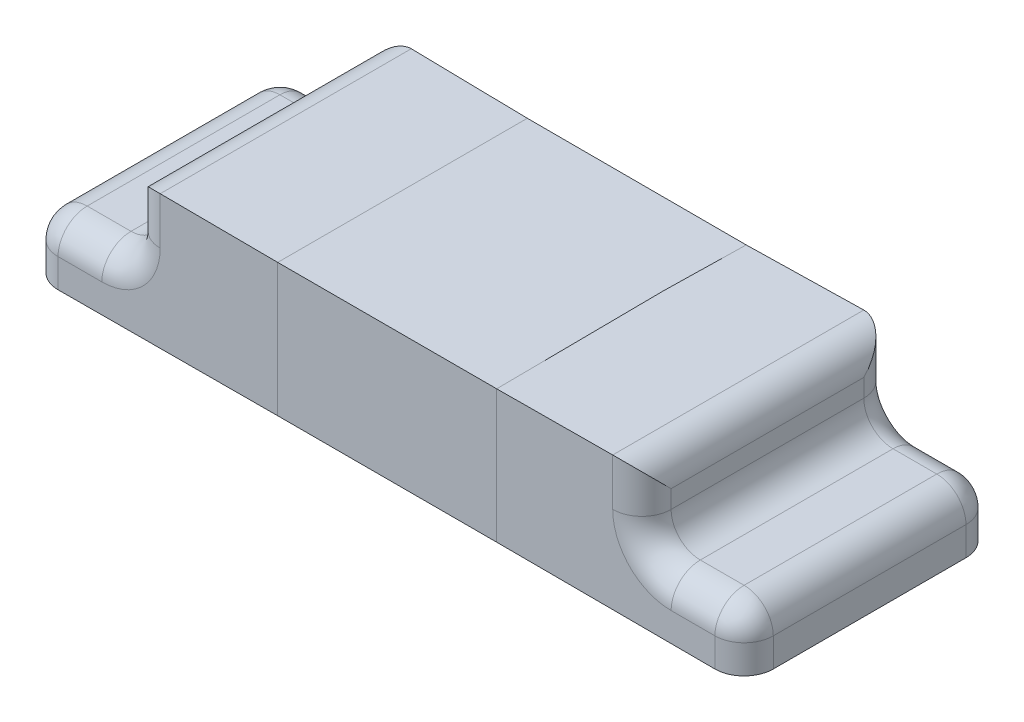
ISO-10303-21;
HEADER;
FILE_DESCRIPTION(('STEP AP214'),'2;1');
FILE_NAME('part.step','',(''),(''),'','','');
FILE_SCHEMA(('AUTOMOTIVE_DESIGN { 1 0 10303 214 1 1 1 1 }'));
ENDSEC;
DATA;
#1=APPLICATION_CONTEXT('core data for automotive mechanical design processes');
#2=APPLICATION_PROTOCOL_DEFINITION('international standard','automotive_design',2000,#1);
#3=PRODUCT_CONTEXT('',#1,'mechanical');
#4=PRODUCT('Part','Part','',(#3));
#5=PRODUCT_RELATED_PRODUCT_CATEGORY('part','',(#4));
#6=PRODUCT_DEFINITION_FORMATION('','',#4);
#7=PRODUCT_DEFINITION_CONTEXT('part definition',#1,'design');
#8=PRODUCT_DEFINITION('design','',#6,#7);
#9=PRODUCT_DEFINITION_SHAPE('','',#8);
#10=(LENGTH_UNIT() NAMED_UNIT(*) SI_UNIT(.MILLI.,.METRE.));
#11=(NAMED_UNIT(*) PLANE_ANGLE_UNIT() SI_UNIT($,.RADIAN.));
#12=(NAMED_UNIT(*) SI_UNIT($,.STERADIAN.) SOLID_ANGLE_UNIT());
#13=UNCERTAINTY_MEASURE_WITH_UNIT(LENGTH_MEASURE(1.E-05),#10,'distance_accuracy_value','');
#14=(GEOMETRIC_REPRESENTATION_CONTEXT(3) GLOBAL_UNCERTAINTY_ASSIGNED_CONTEXT((#13)) GLOBAL_UNIT_ASSIGNED_CONTEXT((#10,
#11,#12)) REPRESENTATION_CONTEXT('',''));
#15=CARTESIAN_POINT('',(0.,0.,0.));
#16=DIRECTION('',(0.,0.,1.));
#17=DIRECTION('',(1.,0.,0.));
#18=AXIS2_PLACEMENT_3D('',#15,#16,#17);
#19=CARTESIAN_POINT('',(0.875,0.,0.));
#20=DIRECTION('',(-1.,0.,0.));
#21=DIRECTION('',(0.,0.,1.));
#22=AXIS2_PLACEMENT_3D('',#19,#20,#21);
#23=PLANE('',#22);
#24=DIRECTION('',(0.,1.,0.));
#25=VECTOR('',#24,1.);
#26=CARTESIAN_POINT('',(0.875,0.,-0.33));
#27=LINE('',#26,#25);
#28=CARTESIAN_POINT('',(0.875,0.298442990090282,-0.33));
#29=VERTEX_POINT('',#28);
#30=CARTESIAN_POINT('',(0.875,0.36,-0.33));
#31=VERTEX_POINT('',#30);
#32=EDGE_CURVE('E509',#29,#31,#27,.T.);
#33=ORIENTED_EDGE('',*,*,#32,.T.);
#34=DIRECTION('',(0.,0.,1.));
#35=VECTOR('',#34,1.);
#36=CARTESIAN_POINT('',(0.875,0.36,0.));
#37=LINE('',#36,#35);
#38=CARTESIAN_POINT('',(0.875,0.36,0.33));
#39=VERTEX_POINT('',#38);
#40=EDGE_CURVE('E484',#31,#39,#37,.T.);
#41=ORIENTED_EDGE('',*,*,#40,.T.);
#42=DIRECTION('',(0.,-1.,0.));
#43=VECTOR('',#42,1.);
#44=CARTESIAN_POINT('',(0.875,0.,0.33));
#45=LINE('',#44,#43);
#46=CARTESIAN_POINT('',(0.875,0.298442990090282,0.33));
#47=VERTEX_POINT('',#46);
#48=EDGE_CURVE('E512',#39,#47,#45,.T.);
#49=ORIENTED_EDGE('',*,*,#48,.T.);
#50=DIRECTION('',(0.,0.,1.));
#51=VECTOR('',#50,1.);
#52=CARTESIAN_POINT('',(0.875,0.298442990090282,-0.43));
#53=LINE('',#52,#51);
#54=EDGE_CURVE('E274',#47,#29,#53,.F.);
#55=ORIENTED_EDGE('',*,*,#54,.T.);
#56=EDGE_LOOP('',(#33,#41,#49,#55));
#57=FACE_BOUND('',#56,.T.);
#58=ADVANCED_FACE('F41',(#57),#23,.F.);
#59=CARTESIAN_POINT('',(0.375,0.,-0.425));
#60=DIRECTION('',(0.,0.,1.));
#61=DIRECTION('',(1.,0.,0.));
#62=AXIS2_PLACEMENT_3D('',#59,#60,#61);
#63=PLANE('',#62);
#64=CARTESIAN_POINT('',(-0.375,0.,-0.425));
#65=DIRECTION('',(0.,1.,0.));
#66=VECTOR('',#65,1.);
#67=LINE('',#64,#66);
#68=CARTESIAN_POINT('',(-0.375,0.,-0.4275));
#69=VERTEX_POINT('',#68);
#70=CARTESIAN_POINT('',(-0.375,0.455,-0.4275));
#71=VERTEX_POINT('',#70);
#72=EDGE_CURVE('E234',#69,#71,#67,.T.);
#73=ORIENTED_EDGE('',*,*,#72,.T.);
#74=DIRECTION('',(-1.,0.,0.));
#75=VECTOR('',#74,1.);
#76=CARTESIAN_POINT('',(0.375,0.45,-0.425));
#77=LINE('',#76,#75);
#78=CARTESIAN_POINT('',(0.375,0.454472135955,-0.4272360679775));
#79=VERTEX_POINT('',#78);
#80=EDGE_CURVE('E271',#79,#71,#77,.T.);
#81=ORIENTED_EDGE('',*,*,#80,.F.);
#82=CARTESIAN_POINT('',(0.375,0.,-0.43));
#83=DIRECTION('',(0.,1.,0.));
#84=VECTOR('',#83,1.);
#85=LINE('',#82,#84);
#86=CARTESIAN_POINT('',(0.375,0.,-0.4275));
#87=VERTEX_POINT('',#86);
#88=EDGE_CURVE('E250',#87,#79,#85,.T.);
#89=ORIENTED_EDGE('',*,*,#88,.F.);
#90=DIRECTION('',(-1.,0.,0.));
#91=VECTOR('',#90,1.);
#92=CARTESIAN_POINT('',(0.375,0.,-0.425));
#93=LINE('',#92,#91);
#94=EDGE_CURVE('E223',#87,#69,#93,.T.);
#95=ORIENTED_EDGE('',*,*,#94,.T.);
#96=EDGE_LOOP('',(#73,#81,#89,#95));
#97=FACE_BOUND('',#96,.T.);
#98=ADVANCED_FACE('F248',(#97),#63,.F.);
#99=CARTESIAN_POINT('',(0.375,0.45,0.425));
#100=DIRECTION('',(0.,-1.,0.));
#101=DIRECTION('',(0.,0.,-1.));
#102=AXIS2_PLACEMENT_3D('',#99,#100,#101);
#103=PLANE('',#102);
#104=CARTESIAN_POINT('',(-0.375,0.45,-0.425));
#105=DIRECTION('',(0.,0.,1.));
#106=VECTOR('',#105,1.);
#107=LINE('',#104,#106);
#108=CARTESIAN_POINT('',(-0.375,0.455,0.4275));
#109=VERTEX_POINT('',#108);
#110=EDGE_CURVE('E244',#71,#109,#107,.T.);
#111=ORIENTED_EDGE('',*,*,#110,.T.);
#112=DIRECTION('',(-1.,0.,0.));
#113=VECTOR('',#112,1.);
#114=CARTESIAN_POINT('',(0.375,0.45,0.425));
#115=LINE('',#114,#113);
#116=CARTESIAN_POINT('',(0.375,0.455,0.4275));
#117=VERTEX_POINT('',#116);
#118=EDGE_CURVE('E256',#117,#109,#115,.T.);
#119=ORIENTED_EDGE('',*,*,#118,.F.);
#120=DIRECTION('',(0.,0.,1.));
#121=VECTOR('',#120,1.);
#122=CARTESIAN_POINT('',(0.375,0.45,0.425));
#123=LINE('',#122,#121);
#124=EDGE_CURVE('E259',#79,#117,#123,.T.);
#125=ORIENTED_EDGE('',*,*,#124,.F.);
#126=ORIENTED_EDGE('',*,*,#80,.T.);
#127=EDGE_LOOP('',(#111,#119,#125,#126));
#128=FACE_BOUND('',#127,.T.);
#129=ADVANCED_FACE('F298',(#128),#103,.F.);
#130=CARTESIAN_POINT('',(0.375,0.,0.425));
#131=DIRECTION('',(0.,0.,-1.));
#132=DIRECTION('',(-1.,0.,0.));
#133=AXIS2_PLACEMENT_3D('',#130,#131,#132);
#134=PLANE('',#133);
#135=CARTESIAN_POINT('',(-0.375,0.45,0.425));
#136=DIRECTION('',(0.,-1.,0.));
#137=VECTOR('',#136,1.);
#138=LINE('',#135,#137);
#139=CARTESIAN_POINT('',(-0.375,0.,0.4275));
#140=VERTEX_POINT('',#139);
#141=EDGE_CURVE('E339',#109,#140,#138,.T.);
#142=ORIENTED_EDGE('',*,*,#141,.T.);
#143=DIRECTION('',(-1.,0.,0.));
#144=VECTOR('',#143,1.);
#145=CARTESIAN_POINT('',(0.375,0.,0.425));
#146=LINE('',#145,#144);
#147=CARTESIAN_POINT('',(0.375,0.,0.4275));
#148=VERTEX_POINT('',#147);
#149=EDGE_CURVE('E252',#148,#140,#146,.T.);
#150=ORIENTED_EDGE('',*,*,#149,.F.);
#151=CARTESIAN_POINT('',(0.375,0.46,0.43));
#152=DIRECTION('',(0.,-1.,0.));
#153=VECTOR('',#152,1.);
#154=LINE('',#151,#153);
#155=EDGE_CURVE('E253',#117,#148,#154,.T.);
#156=ORIENTED_EDGE('',*,*,#155,.F.);
#157=ORIENTED_EDGE('',*,*,#118,.T.);
#158=EDGE_LOOP('',(#142,#150,#156,#157));
#159=FACE_BOUND('',#158,.T.);
#160=ADVANCED_FACE('F288',(#159),#134,.F.);
#161=CARTESIAN_POINT('',(0.375,0.,0.425));
#162=DIRECTION('',(0.,1.,0.));
#163=DIRECTION('',(0.,0.,1.));
#164=AXIS2_PLACEMENT_3D('',#161,#162,#163);
#165=PLANE('',#164);
#166=DIRECTION('',(0.,0.,-1.));
#167=VECTOR('',#166,1.);
#168=CARTESIAN_POINT('',(-1.225,0.,0.43));
#169=LINE('',#168,#167);
#170=CARTESIAN_POINT('',(-1.225,0.,0.33));
#171=VERTEX_POINT('',#170);
#172=CARTESIAN_POINT('',(-1.225,0.,-0.33));
#173=VERTEX_POINT('',#172);
#174=EDGE_CURVE('E328',#171,#173,#169,.T.);
#175=ORIENTED_EDGE('',*,*,#174,.T.);
#176=CARTESIAN_POINT('',(-1.125,0.,-0.33));
#177=DIRECTION('',(0.,1.,0.));
#178=DIRECTION('',(0.,0.,1.));
#179=AXIS2_PLACEMENT_3D('',#176,#177,#178);
#180=CIRCLE('',#179,0.1);
#181=CARTESIAN_POINT('',(-1.125,0.,-0.43));
#182=VERTEX_POINT('',#181);
#183=EDGE_CURVE('E226',#173,#182,#180,.F.);
#184=ORIENTED_EDGE('',*,*,#183,.T.);
#185=DIRECTION('',(1.,0.,0.));
#186=VECTOR('',#185,1.);
#187=CARTESIAN_POINT('',(-0.875,0.,-0.43));
#188=LINE('',#187,#186);
#189=EDGE_CURVE('E217',#182,#69,#188,.T.);
#190=ORIENTED_EDGE('',*,*,#189,.T.);
#191=ORIENTED_EDGE('',*,*,#94,.F.);
#192=DIRECTION('',(-1.,0.,0.));
#193=VECTOR('',#192,1.);
#194=CARTESIAN_POINT('',(0.875,0.,-0.43));
#195=LINE('',#194,#193);
#196=CARTESIAN_POINT('',(1.125,0.,-0.43));
#197=VERTEX_POINT('',#196);
#198=EDGE_CURVE('E466',#197,#87,#195,.T.);
#199=ORIENTED_EDGE('',*,*,#198,.F.);
#200=CARTESIAN_POINT('',(1.125,0.,-0.33));
#201=DIRECTION('',(0.,1.,0.));
#202=DIRECTION('',(0.,0.,1.));
#203=AXIS2_PLACEMENT_3D('',#200,#201,#202);
#204=CIRCLE('',#203,0.1);
#205=CARTESIAN_POINT('',(1.225,0.,-0.33));
#206=VERTEX_POINT('',#205);
#207=EDGE_CURVE('E664',#197,#206,#204,.F.);
#208=ORIENTED_EDGE('',*,*,#207,.T.);
#209=DIRECTION('',(0.,0.,-1.));
#210=VECTOR('',#209,1.);
#211=CARTESIAN_POINT('',(1.225,0.,0.43));
#212=LINE('',#211,#210);
#213=CARTESIAN_POINT('',(1.225,0.,0.33));
#214=VERTEX_POINT('',#213);
#215=EDGE_CURVE('E459',#214,#206,#212,.T.);
#216=ORIENTED_EDGE('',*,*,#215,.F.);
#217=CARTESIAN_POINT('',(1.125,0.,0.33));
#218=DIRECTION('',(0.,1.,0.));
#219=DIRECTION('',(0.,0.,1.));
#220=AXIS2_PLACEMENT_3D('',#217,#218,#219);
#221=CIRCLE('',#220,0.1);
#222=CARTESIAN_POINT('',(1.125,0.,0.43));
#223=VERTEX_POINT('',#222);
#224=EDGE_CURVE('E660',#214,#223,#221,.F.);
#225=ORIENTED_EDGE('',*,*,#224,.T.);
#226=DIRECTION('',(-1.,0.,0.));
#227=VECTOR('',#226,1.);
#228=CARTESIAN_POINT('',(0.875,0.,0.43));
#229=LINE('',#228,#227);
#230=EDGE_CURVE('E410',#223,#148,#229,.T.);
#231=ORIENTED_EDGE('',*,*,#230,.T.);
#232=ORIENTED_EDGE('',*,*,#149,.T.);
#233=DIRECTION('',(1.,0.,0.));
#234=VECTOR('',#233,1.);
#235=CARTESIAN_POINT('',(-0.875,0.,0.43));
#236=LINE('',#235,#234);
#237=CARTESIAN_POINT('',(-1.125,0.,0.43));
#238=VERTEX_POINT('',#237);
#239=EDGE_CURVE('E231',#238,#140,#236,.T.);
#240=ORIENTED_EDGE('',*,*,#239,.F.);
#241=CARTESIAN_POINT('',(-1.125,0.,0.33));
#242=DIRECTION('',(0.,1.,0.));
#243=DIRECTION('',(0.,0.,1.));
#244=AXIS2_PLACEMENT_3D('',#241,#242,#243);
#245=CIRCLE('',#244,0.1);
#246=EDGE_CURVE('E64',#238,#171,#245,.F.);
#247=ORIENTED_EDGE('',*,*,#246,.T.);
#248=EDGE_LOOP('',(#175,#184,#190,#191,#199,#208,#216,#225,#231,#232,#240,#247));
#249=FACE_BOUND('',#248,.T.);
#250=ADVANCED_FACE('F220',(#249),#165,.F.);
#251=CARTESIAN_POINT('',(0.875,0.,-0.43));
#252=DIRECTION('',(0.,0.,1.));
#253=DIRECTION('',(1.,0.,0.));
#254=AXIS2_PLACEMENT_3D('',#251,#252,#253);
#255=PLANE('',#254);
#256=DIRECTION('',(-1.,0.,0.));
#257=VECTOR('',#256,1.);
#258=CARTESIAN_POINT('',(0.875,0.098442990090282,-0.43));
#259=LINE('',#258,#257);
#260=CARTESIAN_POINT('',(0.975,0.098442990090282,-0.43));
#261=VERTEX_POINT('',#260);
#262=CARTESIAN_POINT('',(1.125,0.098442990090282,-0.43));
#263=VERTEX_POINT('',#262);
#264=EDGE_CURVE('E486',#261,#263,#259,.F.);
#265=ORIENTED_EDGE('',*,*,#264,.T.);
#266=DIRECTION('',(0.,1.,0.));
#267=VECTOR('',#266,1.);
#268=CARTESIAN_POINT('',(1.125,0.,-0.43));
#269=LINE('',#268,#267);
#270=EDGE_CURVE('E465',#263,#197,#269,.F.);
#271=ORIENTED_EDGE('',*,*,#270,.T.);
#272=ORIENTED_EDGE('',*,*,#198,.T.);
#273=ORIENTED_EDGE('',*,*,#88,.T.);
#274=DIRECTION('',(-1.,0.,0.));
#275=VECTOR('',#274,1.);
#276=CARTESIAN_POINT('',(0.875,0.46,-0.43));
#277=LINE('',#276,#275);
#278=CARTESIAN_POINT('',(0.775,0.46,-0.43));
#279=VERTEX_POINT('',#278);
#280=EDGE_CURVE('E245',#279,#79,#277,.T.);
#281=ORIENTED_EDGE('',*,*,#280,.F.);
#282=DIRECTION('',(0.,1.,0.));
#283=VECTOR('',#282,1.);
#284=CARTESIAN_POINT('',(0.775,0.,-0.43));
#285=LINE('',#284,#283);
#286=CARTESIAN_POINT('',(0.775,0.298442990090282,-0.43));
#287=VERTEX_POINT('',#286);
#288=EDGE_CURVE('E411',#279,#287,#285,.F.);
#289=ORIENTED_EDGE('',*,*,#288,.T.);
#290=CARTESIAN_POINT('',(0.975,0.298442990090282,-0.43));
#291=DIRECTION('',(0.,0.,1.));
#292=DIRECTION('',(1.,0.,0.));
#293=AXIS2_PLACEMENT_3D('',#290,#291,#292);
#294=CIRCLE('',#293,0.2);
#295=EDGE_CURVE('E488',#261,#287,#294,.F.);
#296=ORIENTED_EDGE('',*,*,#295,.F.);
#297=EDGE_LOOP('',(#265,#271,#272,#273,#281,#289,#296));
#298=FACE_BOUND('',#297,.T.);
#299=ADVANCED_FACE('F496',(#298),#255,.F.);
#300=CARTESIAN_POINT('',(0.875,0.46,0.43));
#301=DIRECTION('',(0.,-1.,0.));
#302=DIRECTION('',(0.,0.,-1.));
#303=AXIS2_PLACEMENT_3D('',#300,#301,#302);
#304=PLANE('',#303);
#305=DIRECTION('',(-1.,0.,0.));
#306=VECTOR('',#305,1.);
#307=CARTESIAN_POINT('',(0.875,0.46,0.43));
#308=LINE('',#307,#306);
#309=CARTESIAN_POINT('',(0.775,0.46,0.43));
#310=VERTEX_POINT('',#309);
#311=EDGE_CURVE('E407',#310,#117,#308,.T.);
#312=ORIENTED_EDGE('',*,*,#311,.F.);
#313=DIRECTION('',(0.,0.,1.));
#314=VECTOR('',#313,1.);
#315=CARTESIAN_POINT('',(0.775,0.46,0.43));
#316=LINE('',#315,#314);
#317=EDGE_CURVE('E420',#310,#279,#316,.F.);
#318=ORIENTED_EDGE('',*,*,#317,.T.);
#319=ORIENTED_EDGE('',*,*,#280,.T.);
#320=DIRECTION('',(0.,0.,1.));
#321=VECTOR('',#320,1.);
#322=CARTESIAN_POINT('',(0.375,0.46,0.43));
#323=LINE('',#322,#321);
#324=EDGE_CURVE('E469',#79,#117,#323,.T.);
#325=ORIENTED_EDGE('',*,*,#324,.T.);
#326=EDGE_LOOP('',(#312,#318,#319,#325));
#327=FACE_BOUND('',#326,.T.);
#328=ADVANCED_FACE('F390',(#327),#304,.F.);
#329=CARTESIAN_POINT('',(0.875,0.,0.43));
#330=DIRECTION('',(0.,0.,-1.));
#331=DIRECTION('',(-1.,0.,0.));
#332=AXIS2_PLACEMENT_3D('',#329,#330,#331);
#333=PLANE('',#332);
#334=ORIENTED_EDGE('',*,*,#230,.F.);
#335=DIRECTION('',(0.,-1.,0.));
#336=VECTOR('',#335,1.);
#337=CARTESIAN_POINT('',(1.125,0.,0.43));
#338=LINE('',#337,#336);
#339=CARTESIAN_POINT('',(1.125,0.098442990090282,0.43));
#340=VERTEX_POINT('',#339);
#341=EDGE_CURVE('E666',#223,#340,#338,.F.);
#342=ORIENTED_EDGE('',*,*,#341,.T.);
#343=DIRECTION('',(-1.,0.,0.));
#344=VECTOR('',#343,1.);
#345=CARTESIAN_POINT('',(0.875,0.098442990090282,0.43));
#346=LINE('',#345,#344);
#347=CARTESIAN_POINT('',(0.975,0.098442990090282,0.43));
#348=VERTEX_POINT('',#347);
#349=EDGE_CURVE('E416',#340,#348,#346,.T.);
#350=ORIENTED_EDGE('',*,*,#349,.T.);
#351=CARTESIAN_POINT('',(0.975,0.298442990090282,0.43));
#352=DIRECTION('',(0.,0.,-1.));
#353=DIRECTION('',(-1.,0.,0.));
#354=AXIS2_PLACEMENT_3D('',#351,#352,#353);
#355=CIRCLE('',#354,0.2);
#356=CARTESIAN_POINT('',(0.775,0.298442990090282,0.43));
#357=VERTEX_POINT('',#356);
#358=EDGE_CURVE('E413',#357,#348,#355,.F.);
#359=ORIENTED_EDGE('',*,*,#358,.F.);
#360=DIRECTION('',(0.,-1.,0.));
#361=VECTOR('',#360,1.);
#362=CARTESIAN_POINT('',(0.775,0.,0.43));
#363=LINE('',#362,#361);
#364=EDGE_CURVE('E418',#357,#310,#363,.F.);
#365=ORIENTED_EDGE('',*,*,#364,.T.);
#366=ORIENTED_EDGE('',*,*,#311,.T.);
#367=ORIENTED_EDGE('',*,*,#155,.T.);
#368=EDGE_LOOP('',(#334,#342,#350,#359,#365,#366,#367));
#369=FACE_BOUND('',#368,.T.);
#370=ADVANCED_FACE('F385',(#369),#333,.F.);
#371=CARTESIAN_POINT('',(0.375,0.,0.));
#372=DIRECTION('',(-1.,0.,0.));
#373=DIRECTION('',(0.,0.,1.));
#374=AXIS2_PLACEMENT_3D('',#371,#372,#373);
#375=PLANE('',#374);
#376=ORIENTED_EDGE('',*,*,#324,.F.);
#377=ORIENTED_EDGE('',*,*,#124,.T.);
#378=EDGE_LOOP('',(#376,#377));
#379=FACE_BOUND('',#378,.T.);
#380=ADVANCED_FACE('F378',(#379),#375,.T.);
#381=CARTESIAN_POINT('',(1.225,0.198442990090282,0.43));
#382=DIRECTION('',(0.,-1.,0.));
#383=DIRECTION('',(0.,0.,-1.));
#384=AXIS2_PLACEMENT_3D('',#381,#382,#383);
#385=PLANE('',#384);
#386=DIRECTION('',(-1.,0.,0.));
#387=VECTOR('',#386,1.);
#388=CARTESIAN_POINT('',(1.225,0.198442990090282,-0.33));
#389=LINE('',#388,#387);
#390=CARTESIAN_POINT('',(1.125,0.198442990090282,-0.33));
#391=VERTEX_POINT('',#390);
#392=CARTESIAN_POINT('',(0.975,0.198442990090282,-0.33));
#393=VERTEX_POINT('',#392);
#394=EDGE_CURVE('E428',#391,#393,#389,.T.);
#395=ORIENTED_EDGE('',*,*,#394,.T.);
#396=DIRECTION('',(0.,0.,1.));
#397=VECTOR('',#396,1.);
#398=CARTESIAN_POINT('',(0.975,0.198442990090282,0.43));
#399=LINE('',#398,#397);
#400=CARTESIAN_POINT('',(0.975,0.198442990090282,0.33));
#401=VERTEX_POINT('',#400);
#402=EDGE_CURVE('E431',#393,#401,#399,.T.);
#403=ORIENTED_EDGE('',*,*,#402,.T.);
#404=DIRECTION('',(-1.,0.,0.));
#405=VECTOR('',#404,1.);
#406=CARTESIAN_POINT('',(1.225,0.198442990090282,0.33));
#407=LINE('',#406,#405);
#408=CARTESIAN_POINT('',(1.125,0.198442990090282,0.33));
#409=VERTEX_POINT('',#408);
#410=EDGE_CURVE('E425',#401,#409,#407,.F.);
#411=ORIENTED_EDGE('',*,*,#410,.T.);
#412=DIRECTION('',(0.,0.,1.));
#413=VECTOR('',#412,1.);
#414=CARTESIAN_POINT('',(1.125,0.198442990090282,0.43));
#415=LINE('',#414,#413);
#416=EDGE_CURVE('E422',#409,#391,#415,.F.);
#417=ORIENTED_EDGE('',*,*,#416,.T.);
#418=EDGE_LOOP('',(#395,#403,#411,#417));
#419=FACE_BOUND('',#418,.T.);
#420=ADVANCED_FACE('F374',(#419),#385,.F.);
#421=CARTESIAN_POINT('',(1.225,0.,0.));
#422=DIRECTION('',(-1.,0.,0.));
#423=DIRECTION('',(0.,0.,1.));
#424=AXIS2_PLACEMENT_3D('',#421,#422,#423);
#425=PLANE('',#424);
#426=ORIENTED_EDGE('',*,*,#215,.T.);
#427=DIRECTION('',(0.,1.,0.));
#428=VECTOR('',#427,1.);
#429=CARTESIAN_POINT('',(1.225,0.,-0.33));
#430=LINE('',#429,#428);
#431=CARTESIAN_POINT('',(1.225,0.098442990090282,-0.33));
#432=VERTEX_POINT('',#431);
#433=EDGE_CURVE('E462',#206,#432,#430,.T.);
#434=ORIENTED_EDGE('',*,*,#433,.T.);
#435=DIRECTION('',(0.,0.,1.));
#436=VECTOR('',#435,1.);
#437=CARTESIAN_POINT('',(1.225,0.098442990090282,0.));
#438=LINE('',#437,#436);
#439=CARTESIAN_POINT('',(1.225,0.098442990090282,0.33));
#440=VERTEX_POINT('',#439);
#441=EDGE_CURVE('E433',#432,#440,#438,.T.);
#442=ORIENTED_EDGE('',*,*,#441,.T.);
#443=DIRECTION('',(0.,-1.,0.));
#444=VECTOR('',#443,1.);
#445=CARTESIAN_POINT('',(1.225,0.,0.33));
#446=LINE('',#445,#444);
#447=EDGE_CURVE('E436',#440,#214,#446,.T.);
#448=ORIENTED_EDGE('',*,*,#447,.T.);
#449=EDGE_LOOP('',(#426,#434,#442,#448));
#450=FACE_BOUND('',#449,.T.);
#451=ADVANCED_FACE('F363',(#450),#425,.F.);
#452=CARTESIAN_POINT('',(0.875,0.098442990090282,0.33));
#453=DIRECTION('',(-1.,0.,0.));
#454=DIRECTION('',(0.,0.,1.));
#455=AXIS2_PLACEMENT_3D('',#452,#453,#454);
#456=CYLINDRICAL_SURFACE('',#455,0.1);
#457=ORIENTED_EDGE('',*,*,#349,.F.);
#458=CARTESIAN_POINT('',(1.125,0.098442990090282,0.33));
#459=DIRECTION('',(-1.,0.,0.));
#460=DIRECTION('',(0.,0.,1.));
#461=AXIS2_PLACEMENT_3D('',#458,#459,#460);
#462=CIRCLE('',#461,0.1);
#463=EDGE_CURVE('E674',#340,#409,#462,.T.);
#464=ORIENTED_EDGE('',*,*,#463,.T.);
#465=ORIENTED_EDGE('',*,*,#410,.F.);
#466=CARTESIAN_POINT('',(0.975,0.098442990090282,0.33));
#467=DIRECTION('',(-1.,0.,0.));
#468=DIRECTION('',(0.,0.,1.));
#469=AXIS2_PLACEMENT_3D('',#466,#467,#468);
#470=CIRCLE('',#469,0.1);
#471=EDGE_CURVE('E456',#348,#401,#470,.T.);
#472=ORIENTED_EDGE('',*,*,#471,.F.);
#473=EDGE_LOOP('',(#457,#464,#465,#472));
#474=FACE_BOUND('',#473,.T.);
#475=ADVANCED_FACE('F373',(#474),#456,.T.);
#476=CARTESIAN_POINT('',(1.125,0.098442990090282,0.));
#477=DIRECTION('',(0.,0.,1.));
#478=DIRECTION('',(1.,0.,0.));
#479=AXIS2_PLACEMENT_3D('',#476,#477,#478);
#480=CYLINDRICAL_SURFACE('',#479,0.1);
#481=ORIENTED_EDGE('',*,*,#441,.F.);
#482=CARTESIAN_POINT('',(1.125,0.098442990090282,-0.33));
#483=DIRECTION('',(0.,0.,1.));
#484=DIRECTION('',(1.,0.,0.));
#485=AXIS2_PLACEMENT_3D('',#482,#483,#484);
#486=CIRCLE('',#485,0.1);
#487=EDGE_CURVE('E672',#432,#391,#486,.T.);
#488=ORIENTED_EDGE('',*,*,#487,.T.);
#489=ORIENTED_EDGE('',*,*,#416,.F.);
#490=CARTESIAN_POINT('',(1.125,0.098442990090282,0.33));
#491=DIRECTION('',(0.,0.,1.));
#492=DIRECTION('',(1.,0.,0.));
#493=AXIS2_PLACEMENT_3D('',#490,#491,#492);
#494=CIRCLE('',#493,0.1);
#495=EDGE_CURVE('E670',#409,#440,#494,.F.);
#496=ORIENTED_EDGE('',*,*,#495,.T.);
#497=EDGE_LOOP('',(#481,#488,#489,#496));
#498=FACE_BOUND('',#497,.T.);
#499=ADVANCED_FACE('F549',(#498),#480,.T.);
#500=CARTESIAN_POINT('',(0.975,0.298442990090282,0.33));
#501=DIRECTION('',(0.,0.,-1.));
#502=DIRECTION('',(-1.,0.,0.));
#503=AXIS2_PLACEMENT_3D('',#500,#501,#502);
#504=TOROIDAL_SURFACE('',#503,0.2,0.1);
#505=ORIENTED_EDGE('',*,*,#358,.T.);
#506=ORIENTED_EDGE('',*,*,#471,.T.);
#507=CARTESIAN_POINT('',(0.975,0.298442990090282,0.33));
#508=DIRECTION('',(0.,0.,-1.));
#509=DIRECTION('',(-1.,0.,0.));
#510=AXIS2_PLACEMENT_3D('',#507,#508,#509);
#511=CIRCLE('',#510,0.1);
#512=EDGE_CURVE('E453',#47,#401,#511,.F.);
#513=ORIENTED_EDGE('',*,*,#512,.F.);
#514=CARTESIAN_POINT('',(0.775,0.298442990090282,0.33));
#515=DIRECTION('',(0.,-1.,0.));
#516=DIRECTION('',(0.,0.,-1.));
#517=AXIS2_PLACEMENT_3D('',#514,#515,#516);
#518=CIRCLE('',#517,0.1);
#519=EDGE_CURVE('E450',#357,#47,#518,.F.);
#520=ORIENTED_EDGE('',*,*,#519,.F.);
#521=EDGE_LOOP('',(#505,#506,#513,#520));
#522=FACE_BOUND('',#521,.T.);
#523=ADVANCED_FACE('F524',(#522),#504,.T.);
#524=CARTESIAN_POINT('',(1.225,0.098442990090282,-0.33));
#525=DIRECTION('',(-1.,0.,0.));
#526=DIRECTION('',(0.,0.,1.));
#527=AXIS2_PLACEMENT_3D('',#524,#525,#526);
#528=CYLINDRICAL_SURFACE('',#527,0.1);
#529=ORIENTED_EDGE('',*,*,#394,.F.);
#530=CARTESIAN_POINT('',(1.125,0.098442990090282,-0.33));
#531=DIRECTION('',(-1.,0.,0.));
#532=DIRECTION('',(0.,0.,1.));
#533=AXIS2_PLACEMENT_3D('',#530,#531,#532);
#534=CIRCLE('',#533,0.1);
#535=EDGE_CURVE('E668',#391,#263,#534,.T.);
#536=ORIENTED_EDGE('',*,*,#535,.T.);
#537=ORIENTED_EDGE('',*,*,#264,.F.);
#538=CARTESIAN_POINT('',(0.975,0.098442990090282,-0.33));
#539=DIRECTION('',(-1.,0.,0.));
#540=DIRECTION('',(0.,0.,1.));
#541=AXIS2_PLACEMENT_3D('',#538,#539,#540);
#542=CIRCLE('',#541,0.1);
#543=EDGE_CURVE('E447',#393,#261,#542,.T.);
#544=ORIENTED_EDGE('',*,*,#543,.F.);
#545=EDGE_LOOP('',(#529,#536,#537,#544));
#546=FACE_BOUND('',#545,.T.);
#547=ADVANCED_FACE('F543',(#546),#528,.T.);
#548=CARTESIAN_POINT('',(0.975,0.298442990090282,0.43));
#549=DIRECTION('',(0.,0.,-1.));
#550=DIRECTION('',(-1.,0.,0.));
#551=AXIS2_PLACEMENT_3D('',#548,#549,#550);
#552=CYLINDRICAL_SURFACE('',#551,0.1);
#553=ORIENTED_EDGE('',*,*,#512,.T.);
#554=ORIENTED_EDGE('',*,*,#402,.F.);
#555=CARTESIAN_POINT('',(0.975,0.298442990090282,-0.33));
#556=DIRECTION('',(0.,0.,1.));
#557=DIRECTION('',(1.,0.,0.));
#558=AXIS2_PLACEMENT_3D('',#555,#556,#557);
#559=CIRCLE('',#558,0.1);
#560=EDGE_CURVE('E445',#29,#393,#559,.T.);
#561=ORIENTED_EDGE('',*,*,#560,.F.);
#562=ORIENTED_EDGE('',*,*,#54,.F.);
#563=EDGE_LOOP('',(#553,#554,#561,#562));
#564=FACE_BOUND('',#563,.T.);
#565=ADVANCED_FACE('F528',(#564),#552,.F.);
#566=CARTESIAN_POINT('',(0.775,0.,0.33));
#567=DIRECTION('',(0.,-1.,0.));
#568=DIRECTION('',(0.,0.,-1.));
#569=AXIS2_PLACEMENT_3D('',#566,#567,#568);
#570=CYLINDRICAL_SURFACE('',#569,0.1);
#571=ORIENTED_EDGE('',*,*,#519,.T.);
#572=ORIENTED_EDGE('',*,*,#48,.F.);
#573=CARTESIAN_POINT('',(0.775,0.36,0.33));
#574=DIRECTION('',(0.,-0.707106781186547,0.707106781186547));
#575=DIRECTION('',(0.,0.707106781186547,0.707106781186547));
#576=AXIS2_PLACEMENT_3D('',#573,#574,#575);
#577=ELLIPSE('',#576,0.14142135623731,0.1);
#578=EDGE_CURVE('E442',#310,#39,#577,.F.);
#579=ORIENTED_EDGE('',*,*,#578,.F.);
#580=ORIENTED_EDGE('',*,*,#364,.F.);
#581=EDGE_LOOP('',(#571,#572,#579,#580));
#582=FACE_BOUND('',#581,.T.);
#583=ADVANCED_FACE('F522',(#582),#570,.T.);
#584=CARTESIAN_POINT('',(0.975,0.298442990090282,-0.33));
#585=DIRECTION('',(0.,0.,1.));
#586=DIRECTION('',(1.,0.,0.));
#587=AXIS2_PLACEMENT_3D('',#584,#585,#586);
#588=TOROIDAL_SURFACE('',#587,0.2,0.1);
#589=ORIENTED_EDGE('',*,*,#543,.T.);
#590=ORIENTED_EDGE('',*,*,#295,.T.);
#591=CARTESIAN_POINT('',(0.775,0.298442990090282,-0.33));
#592=DIRECTION('',(0.,-1.,0.));
#593=DIRECTION('',(0.,0.,-1.));
#594=AXIS2_PLACEMENT_3D('',#591,#592,#593);
#595=CIRCLE('',#594,0.1);
#596=EDGE_CURVE('E439',#29,#287,#595,.F.);
#597=ORIENTED_EDGE('',*,*,#596,.F.);
#598=ORIENTED_EDGE('',*,*,#560,.T.);
#599=EDGE_LOOP('',(#589,#590,#597,#598));
#600=FACE_BOUND('',#599,.T.);
#601=ADVANCED_FACE('F530',(#600),#588,.T.);
#602=CARTESIAN_POINT('',(0.775,0.36,0.));
#603=DIRECTION('',(0.,0.,1.));
#604=DIRECTION('',(1.,0.,0.));
#605=AXIS2_PLACEMENT_3D('',#602,#603,#604);
#606=CYLINDRICAL_SURFACE('',#605,0.1);
#607=ORIENTED_EDGE('',*,*,#578,.T.);
#608=ORIENTED_EDGE('',*,*,#40,.F.);
#609=CARTESIAN_POINT('',(0.775,0.36,-0.33));
#610=DIRECTION('',(0.,0.707106781186547,0.707106781186547));
#611=DIRECTION('',(0.,-0.707106781186547,0.707106781186547));
#612=AXIS2_PLACEMENT_3D('',#609,#610,#611);
#613=ELLIPSE('',#612,0.14142135623731,0.1);
#614=EDGE_CURVE('E437',#279,#31,#613,.F.);
#615=ORIENTED_EDGE('',*,*,#614,.F.);
#616=ORIENTED_EDGE('',*,*,#317,.F.);
#617=EDGE_LOOP('',(#607,#608,#615,#616));
#618=FACE_BOUND('',#617,.T.);
#619=ADVANCED_FACE('F505',(#618),#606,.T.);
#620=CARTESIAN_POINT('',(0.775,0.,-0.33));
#621=DIRECTION('',(0.,1.,0.));
#622=DIRECTION('',(0.,0.,1.));
#623=AXIS2_PLACEMENT_3D('',#620,#621,#622);
#624=CYLINDRICAL_SURFACE('',#623,0.1);
#625=ORIENTED_EDGE('',*,*,#596,.T.);
#626=ORIENTED_EDGE('',*,*,#288,.F.);
#627=ORIENTED_EDGE('',*,*,#614,.T.);
#628=ORIENTED_EDGE('',*,*,#32,.F.);
#629=EDGE_LOOP('',(#625,#626,#627,#628));
#630=FACE_BOUND('',#629,.T.);
#631=ADVANCED_FACE('F500',(#630),#624,.T.);
#632=CARTESIAN_POINT('',(1.125,0.098442990090282,-0.33));
#633=DIRECTION('',(0.,0.,1.));
#634=DIRECTION('',(1.,0.,0.));
#635=AXIS2_PLACEMENT_3D('',#632,#633,#634);
#636=SPHERICAL_SURFACE('',#635,0.1);
#637=ORIENTED_EDGE('',*,*,#535,.F.);
#638=ORIENTED_EDGE('',*,*,#487,.F.);
#639=CARTESIAN_POINT('',(1.125,0.098442990090282,-0.33));
#640=DIRECTION('',(0.,-1.,0.));
#641=DIRECTION('',(0.,0.,-1.));
#642=AXIS2_PLACEMENT_3D('',#639,#640,#641);
#643=CIRCLE('',#642,0.1);
#644=EDGE_CURVE('E440',#263,#432,#643,.T.);
#645=ORIENTED_EDGE('',*,*,#644,.F.);
#646=EDGE_LOOP('',(#637,#638,#645));
#647=FACE_BOUND('',#646,.T.);
#648=ADVANCED_FACE('F560',(#647),#636,.T.);
#649=CARTESIAN_POINT('',(1.125,0.,-0.33));
#650=DIRECTION('',(0.,1.,0.));
#651=DIRECTION('',(0.,0.,1.));
#652=AXIS2_PLACEMENT_3D('',#649,#650,#651);
#653=CYLINDRICAL_SURFACE('',#652,0.1);
#654=ORIENTED_EDGE('',*,*,#207,.F.);
#655=ORIENTED_EDGE('',*,*,#270,.F.);
#656=ORIENTED_EDGE('',*,*,#644,.T.);
#657=ORIENTED_EDGE('',*,*,#433,.F.);
#658=EDGE_LOOP('',(#654,#655,#656,#657));
#659=FACE_BOUND('',#658,.T.);
#660=ADVANCED_FACE('F556',(#659),#653,.T.);
#661=CARTESIAN_POINT('',(1.125,0.098442990090282,0.33));
#662=DIRECTION('',(0.,0.,1.));
#663=DIRECTION('',(1.,0.,0.));
#664=AXIS2_PLACEMENT_3D('',#661,#662,#663);
#665=SPHERICAL_SURFACE('',#664,0.1);
#666=ORIENTED_EDGE('',*,*,#495,.F.);
#667=ORIENTED_EDGE('',*,*,#463,.F.);
#668=CARTESIAN_POINT('',(1.125,0.098442990090282,0.33));
#669=DIRECTION('',(0.,-1.,0.));
#670=DIRECTION('',(0.,0.,-1.));
#671=AXIS2_PLACEMENT_3D('',#668,#669,#670);
#672=CIRCLE('',#671,0.1);
#673=EDGE_CURVE('E230',#440,#340,#672,.T.);
#674=ORIENTED_EDGE('',*,*,#673,.F.);
#675=EDGE_LOOP('',(#666,#667,#674));
#676=FACE_BOUND('',#675,.T.);
#677=ADVANCED_FACE('F559',(#676),#665,.T.);
#678=CARTESIAN_POINT('',(1.125,0.,0.33));
#679=DIRECTION('',(0.,-1.,0.));
#680=DIRECTION('',(0.,0.,-1.));
#681=AXIS2_PLACEMENT_3D('',#678,#679,#680);
#682=CYLINDRICAL_SURFACE('',#681,0.1);
#683=ORIENTED_EDGE('',*,*,#673,.T.);
#684=ORIENTED_EDGE('',*,*,#341,.F.);
#685=ORIENTED_EDGE('',*,*,#224,.F.);
#686=ORIENTED_EDGE('',*,*,#447,.F.);
#687=EDGE_LOOP('',(#683,#684,#685,#686));
#688=FACE_BOUND('',#687,.T.);
#689=ADVANCED_FACE('F362',(#688),#682,.T.);
#690=CARTESIAN_POINT('',(-0.875,0.,-0.43));
#691=DIRECTION('',(0.,0.,-1.));
#692=DIRECTION('',(-1.,0.,0.));
#693=AXIS2_PLACEMENT_3D('',#690,#691,#692);
#694=PLANE('',#693);
#695=ORIENTED_EDGE('',*,*,#189,.F.);
#696=DIRECTION('',(0.,1.,0.));
#697=VECTOR('',#696,1.);
#698=CARTESIAN_POINT('',(-1.125,0.098442990090282,-0.43));
#699=LINE('',#698,#697);
#700=CARTESIAN_POINT('',(-1.125,0.098442990090282,-0.43));
#701=VERTEX_POINT('',#700);
#702=EDGE_CURVE('E1066',#182,#701,#699,.T.);
#703=ORIENTED_EDGE('',*,*,#702,.T.);
#704=DIRECTION('',(1.,0.,0.));
#705=VECTOR('',#704,1.);
#706=CARTESIAN_POINT('',(-0.875,0.098442990090282,-0.43));
#707=LINE('',#706,#705);
#708=CARTESIAN_POINT('',(-0.975,0.098442990090282,-0.43));
#709=VERTEX_POINT('',#708);
#710=EDGE_CURVE('E1073',#701,#709,#707,.T.);
#711=ORIENTED_EDGE('',*,*,#710,.T.);
#712=CARTESIAN_POINT('',(-0.975,0.298442990090282,-0.43));
#713=DIRECTION('',(0.,0.,-1.));
#714=DIRECTION('',(-1.,0.,0.));
#715=AXIS2_PLACEMENT_3D('',#712,#713,#714);
#716=CIRCLE('',#715,0.2);
#717=CARTESIAN_POINT('',(-0.775,0.298442990090282,-0.43));
#718=VERTEX_POINT('',#717);
#719=EDGE_CURVE('E329',#718,#709,#716,.T.);
#720=ORIENTED_EDGE('',*,*,#719,.F.);
#721=DIRECTION('',(0.,1.,0.));
#722=VECTOR('',#721,1.);
#723=CARTESIAN_POINT('',(-0.775,0.46,-0.43));
#724=LINE('',#723,#722);
#725=CARTESIAN_POINT('',(-0.775,0.46,-0.43));
#726=VERTEX_POINT('',#725);
#727=EDGE_CURVE('E1079',#718,#726,#724,.T.);
#728=ORIENTED_EDGE('',*,*,#727,.T.);
#729=DIRECTION('',(1.,0.,0.));
#730=VECTOR('',#729,1.);
#731=CARTESIAN_POINT('',(-0.875,0.46,-0.43));
#732=LINE('',#731,#730);
#733=EDGE_CURVE('E239',#726,#71,#732,.T.);
#734=ORIENTED_EDGE('',*,*,#733,.T.);
#735=ORIENTED_EDGE('',*,*,#72,.F.);
#736=EDGE_LOOP('',(#695,#703,#711,#720,#728,#734,#735));
#737=FACE_BOUND('',#736,.T.);
#738=ADVANCED_FACE('F236',(#737),#694,.T.);
#739=CARTESIAN_POINT('',(-0.875,0.,0.43));
#740=DIRECTION('',(0.,0.,1.));
#741=DIRECTION('',(1.,0.,0.));
#742=AXIS2_PLACEMENT_3D('',#739,#740,#741);
#743=PLANE('',#742);
#744=DIRECTION('',(1.,0.,0.));
#745=VECTOR('',#744,1.);
#746=CARTESIAN_POINT('',(-0.875,0.098442990090282,0.43));
#747=LINE('',#746,#745);
#748=CARTESIAN_POINT('',(-0.975,0.098442990090282,0.43));
#749=VERTEX_POINT('',#748);
#750=CARTESIAN_POINT('',(-1.125,0.098442990090282,0.43));
#751=VERTEX_POINT('',#750);
#752=EDGE_CURVE('E1091',#749,#751,#747,.F.);
#753=ORIENTED_EDGE('',*,*,#752,.T.);
#754=DIRECTION('',(0.,-1.,0.));
#755=VECTOR('',#754,1.);
#756=CARTESIAN_POINT('',(-1.125,0.,0.43));
#757=LINE('',#756,#755);
#758=EDGE_CURVE('E623',#751,#238,#757,.T.);
#759=ORIENTED_EDGE('',*,*,#758,.T.);
#760=ORIENTED_EDGE('',*,*,#239,.T.);
#761=ORIENTED_EDGE('',*,*,#141,.F.);
#762=DIRECTION('',(1.,0.,0.));
#763=VECTOR('',#762,1.);
#764=CARTESIAN_POINT('',(-0.875,0.46,0.43));
#765=LINE('',#764,#763);
#766=CARTESIAN_POINT('',(-0.775,0.46,0.43));
#767=VERTEX_POINT('',#766);
#768=EDGE_CURVE('E327',#767,#109,#765,.T.);
#769=ORIENTED_EDGE('',*,*,#768,.F.);
#770=DIRECTION('',(0.,-1.,0.));
#771=VECTOR('',#770,1.);
#772=CARTESIAN_POINT('',(-0.775,0.198442990090282,0.43));
#773=LINE('',#772,#771);
#774=CARTESIAN_POINT('',(-0.775,0.298442990090282,0.43));
#775=VERTEX_POINT('',#774);
#776=EDGE_CURVE('E1097',#767,#775,#773,.T.);
#777=ORIENTED_EDGE('',*,*,#776,.T.);
#778=CARTESIAN_POINT('',(-0.975,0.298442990090282,0.43));
#779=DIRECTION('',(0.,0.,1.));
#780=DIRECTION('',(1.,0.,0.));
#781=AXIS2_PLACEMENT_3D('',#778,#779,#780);
#782=CIRCLE('',#781,0.2);
#783=EDGE_CURVE('E1094',#749,#775,#782,.T.);
#784=ORIENTED_EDGE('',*,*,#783,.F.);
#785=EDGE_LOOP('',(#753,#759,#760,#761,#769,#777,#784));
#786=FACE_BOUND('',#785,.T.);
#787=ADVANCED_FACE('F346',(#786),#743,.T.);
#788=CARTESIAN_POINT('',(-0.875,0.46,0.43));
#789=DIRECTION('',(0.,1.,0.));
#790=DIRECTION('',(0.,0.,1.));
#791=AXIS2_PLACEMENT_3D('',#788,#789,#790);
#792=PLANE('',#791);
#793=ORIENTED_EDGE('',*,*,#733,.F.);
#794=DIRECTION('',(0.,0.,1.));
#795=VECTOR('',#794,1.);
#796=CARTESIAN_POINT('',(-0.775,0.46,0.43));
#797=LINE('',#796,#795);
#798=EDGE_CURVE('E1099',#726,#767,#797,.T.);
#799=ORIENTED_EDGE('',*,*,#798,.T.);
#800=ORIENTED_EDGE('',*,*,#768,.T.);
#801=ORIENTED_EDGE('',*,*,#110,.F.);
#802=EDGE_LOOP('',(#793,#799,#800,#801));
#803=FACE_BOUND('',#802,.T.);
#804=ADVANCED_FACE('F356',(#803),#792,.T.);
#805=CARTESIAN_POINT('',(-0.875,0.,0.));
#806=DIRECTION('',(1.,0.,0.));
#807=DIRECTION('',(0.,0.,1.));
#808=AXIS2_PLACEMENT_3D('',#805,#806,#807);
#809=PLANE('',#808);
#810=DIRECTION('',(0.,-1.,0.));
#811=VECTOR('',#810,1.);
#812=CARTESIAN_POINT('',(-0.875,0.46,0.33));
#813=LINE('',#812,#811);
#814=CARTESIAN_POINT('',(-0.875,0.298442990090282,0.33));
#815=VERTEX_POINT('',#814);
#816=CARTESIAN_POINT('',(-0.875,0.36,0.33));
#817=VERTEX_POINT('',#816);
#818=EDGE_CURVE('E1084',#815,#817,#813,.F.);
#819=ORIENTED_EDGE('',*,*,#818,.T.);
#820=DIRECTION('',(0.,0.,1.));
#821=VECTOR('',#820,1.);
#822=CARTESIAN_POINT('',(-0.875,0.36,-0.43));
#823=LINE('',#822,#821);
#824=CARTESIAN_POINT('',(-0.875,0.36,-0.33));
#825=VERTEX_POINT('',#824);
#826=EDGE_CURVE('E1089',#817,#825,#823,.F.);
#827=ORIENTED_EDGE('',*,*,#826,.T.);
#828=DIRECTION('',(0.,1.,0.));
#829=VECTOR('',#828,1.);
#830=CARTESIAN_POINT('',(-0.875,0.198442990090282,-0.33));
#831=LINE('',#830,#829);
#832=CARTESIAN_POINT('',(-0.875,0.298442990090282,-0.33));
#833=VERTEX_POINT('',#832);
#834=EDGE_CURVE('E1086',#825,#833,#831,.F.);
#835=ORIENTED_EDGE('',*,*,#834,.T.);
#836=DIRECTION('',(0.,0.,1.));
#837=VECTOR('',#836,1.);
#838=CARTESIAN_POINT('',(-0.875,0.298442990090282,0.));
#839=LINE('',#838,#837);
#840=EDGE_CURVE('E1080',#833,#815,#839,.T.);
#841=ORIENTED_EDGE('',*,*,#840,.T.);
#842=EDGE_LOOP('',(#819,#827,#835,#841));
#843=FACE_BOUND('',#842,.T.);
#844=ADVANCED_FACE('F728',(#843),#809,.F.);
#845=CARTESIAN_POINT('',(-1.225,0.198442990090282,0.43));
#846=DIRECTION('',(0.,1.,0.));
#847=DIRECTION('',(0.,0.,1.));
#848=AXIS2_PLACEMENT_3D('',#845,#846,#847);
#849=PLANE('',#848);
#850=DIRECTION('',(1.,0.,0.));
#851=VECTOR('',#850,1.);
#852=CARTESIAN_POINT('',(-1.225,0.198442990090282,0.33));
#853=LINE('',#852,#851);
#854=CARTESIAN_POINT('',(-1.125,0.198442990090282,0.33));
#855=VERTEX_POINT('',#854);
#856=CARTESIAN_POINT('',(-0.975,0.198442990090282,0.33));
#857=VERTEX_POINT('',#856);
#858=EDGE_CURVE('E1104',#855,#857,#853,.T.);
#859=ORIENTED_EDGE('',*,*,#858,.T.);
#860=DIRECTION('',(0.,0.,1.));
#861=VECTOR('',#860,1.);
#862=CARTESIAN_POINT('',(-0.975,0.198442990090282,0.43));
#863=LINE('',#862,#861);
#864=CARTESIAN_POINT('',(-0.975,0.198442990090282,-0.33));
#865=VERTEX_POINT('',#864);
#866=EDGE_CURVE('E1067',#857,#865,#863,.F.);
#867=ORIENTED_EDGE('',*,*,#866,.T.);
#868=DIRECTION('',(1.,0.,0.));
#869=VECTOR('',#868,1.);
#870=CARTESIAN_POINT('',(-1.225,0.198442990090282,-0.33));
#871=LINE('',#870,#869);
#872=CARTESIAN_POINT('',(-1.125,0.198442990090282,-0.33));
#873=VERTEX_POINT('',#872);
#874=EDGE_CURVE('E1106',#865,#873,#871,.F.);
#875=ORIENTED_EDGE('',*,*,#874,.T.);
#876=DIRECTION('',(0.,0.,1.));
#877=VECTOR('',#876,1.);
#878=CARTESIAN_POINT('',(-1.125,0.198442990090282,0.43));
#879=LINE('',#878,#877);
#880=EDGE_CURVE('E1101',#873,#855,#879,.T.);
#881=ORIENTED_EDGE('',*,*,#880,.T.);
#882=EDGE_LOOP('',(#859,#867,#875,#881));
#883=FACE_BOUND('',#882,.T.);
#884=ADVANCED_FACE('F734',(#883),#849,.T.);
#885=CARTESIAN_POINT('',(-1.225,0.,0.));
#886=DIRECTION('',(1.,0.,0.));
#887=DIRECTION('',(0.,0.,1.));
#888=AXIS2_PLACEMENT_3D('',#885,#886,#887);
#889=PLANE('',#888);
#890=DIRECTION('',(0.,0.,1.));
#891=VECTOR('',#890,1.);
#892=CARTESIAN_POINT('',(-1.225,0.098442990090282,-0.43));
#893=LINE('',#892,#891);
#894=CARTESIAN_POINT('',(-1.225,0.098442990090282,0.33));
#895=VERTEX_POINT('',#894);
#896=CARTESIAN_POINT('',(-1.225,0.098442990090282,-0.33));
#897=VERTEX_POINT('',#896);
#898=EDGE_CURVE('E1064',#895,#897,#893,.F.);
#899=ORIENTED_EDGE('',*,*,#898,.T.);
#900=DIRECTION('',(0.,1.,0.));
#901=VECTOR('',#900,1.);
#902=CARTESIAN_POINT('',(-1.225,0.,-0.33));
#903=LINE('',#902,#901);
#904=EDGE_CURVE('E641',#897,#173,#903,.F.);
#905=ORIENTED_EDGE('',*,*,#904,.T.);
#906=ORIENTED_EDGE('',*,*,#174,.F.);
#907=DIRECTION('',(0.,-1.,0.));
#908=VECTOR('',#907,1.);
#909=CARTESIAN_POINT('',(-1.225,0.098442990090282,0.33));
#910=LINE('',#909,#908);
#911=EDGE_CURVE('E622',#171,#895,#910,.F.);
#912=ORIENTED_EDGE('',*,*,#911,.T.);
#913=EDGE_LOOP('',(#899,#905,#906,#912));
#914=FACE_BOUND('',#913,.T.);
#915=ADVANCED_FACE('F607',(#914),#889,.F.);
#916=CARTESIAN_POINT('',(-1.225,0.098442990090282,0.33));
#917=DIRECTION('',(1.,0.,0.));
#918=DIRECTION('',(0.,0.,-1.));
#919=AXIS2_PLACEMENT_3D('',#916,#917,#918);
#920=CYLINDRICAL_SURFACE('',#919,0.1);
#921=ORIENTED_EDGE('',*,*,#858,.F.);
#922=CARTESIAN_POINT('',(-1.125,0.098442990090282,0.33));
#923=DIRECTION('',(1.,0.,0.));
#924=DIRECTION('',(0.,0.,-1.));
#925=AXIS2_PLACEMENT_3D('',#922,#923,#924);
#926=CIRCLE('',#925,0.1);
#927=EDGE_CURVE('E11',#855,#751,#926,.T.);
#928=ORIENTED_EDGE('',*,*,#927,.T.);
#929=ORIENTED_EDGE('',*,*,#752,.F.);
#930=CARTESIAN_POINT('',(-0.975,0.098442990090282,0.33));
#931=DIRECTION('',(1.,0.,0.));
#932=DIRECTION('',(0.,0.,-1.));
#933=AXIS2_PLACEMENT_3D('',#930,#931,#932);
#934=CIRCLE('',#933,0.1);
#935=EDGE_CURVE('E1124',#857,#749,#934,.T.);
#936=ORIENTED_EDGE('',*,*,#935,.F.);
#937=EDGE_LOOP('',(#921,#928,#929,#936));
#938=FACE_BOUND('',#937,.T.);
#939=ADVANCED_FACE('F603',(#938),#920,.T.);
#940=CARTESIAN_POINT('',(-1.125,0.098442990090282,0.43));
#941=DIRECTION('',(0.,0.,-1.));
#942=DIRECTION('',(-1.,0.,0.));
#943=AXIS2_PLACEMENT_3D('',#940,#941,#942);
#944=CYLINDRICAL_SURFACE('',#943,0.1);
#945=ORIENTED_EDGE('',*,*,#880,.F.);
#946=CARTESIAN_POINT('',(-1.125,0.098442990090282,-0.33));
#947=DIRECTION('',(0.,0.,-1.));
#948=DIRECTION('',(-1.,0.,0.));
#949=AXIS2_PLACEMENT_3D('',#946,#947,#948);
#950=CIRCLE('',#949,0.1);
#951=EDGE_CURVE('E50',#873,#897,#950,.F.);
#952=ORIENTED_EDGE('',*,*,#951,.T.);
#953=ORIENTED_EDGE('',*,*,#898,.F.);
#954=CARTESIAN_POINT('',(-1.125,0.098442990090282,0.33));
#955=DIRECTION('',(0.,0.,-1.));
#956=DIRECTION('',(-1.,0.,0.));
#957=AXIS2_PLACEMENT_3D('',#954,#955,#956);
#958=CIRCLE('',#957,0.1);
#959=EDGE_CURVE('E634',#895,#855,#958,.T.);
#960=ORIENTED_EDGE('',*,*,#959,.T.);
#961=EDGE_LOOP('',(#945,#952,#953,#960));
#962=FACE_BOUND('',#961,.T.);
#963=ADVANCED_FACE('F599',(#962),#944,.T.);
#964=CARTESIAN_POINT('',(-0.975,0.298442990090282,0.33));
#965=DIRECTION('',(0.,0.,1.));
#966=DIRECTION('',(1.,0.,0.));
#967=AXIS2_PLACEMENT_3D('',#964,#965,#966);
#968=TOROIDAL_SURFACE('',#967,0.2,0.1);
#969=CARTESIAN_POINT('',(-0.775,0.298442990090282,0.33));
#970=DIRECTION('',(0.,-1.,0.));
#971=DIRECTION('',(0.,0.,-1.));
#972=AXIS2_PLACEMENT_3D('',#969,#970,#971);
#973=CIRCLE('',#972,0.1);
#974=EDGE_CURVE('E1118',#815,#775,#973,.F.);
#975=ORIENTED_EDGE('',*,*,#974,.F.);
#976=CARTESIAN_POINT('',(-0.975,0.298442990090282,0.33));
#977=DIRECTION('',(0.,0.,1.));
#978=DIRECTION('',(1.,0.,0.));
#979=AXIS2_PLACEMENT_3D('',#976,#977,#978);
#980=CIRCLE('',#979,0.1);
#981=EDGE_CURVE('E1121',#857,#815,#980,.T.);
#982=ORIENTED_EDGE('',*,*,#981,.F.);
#983=ORIENTED_EDGE('',*,*,#935,.T.);
#984=ORIENTED_EDGE('',*,*,#783,.T.);
#985=EDGE_LOOP('',(#975,#982,#983,#984));
#986=FACE_BOUND('',#985,.T.);
#987=ADVANCED_FACE('F595',(#986),#968,.T.);
#988=CARTESIAN_POINT('',(-0.975,0.298442990090282,0.));
#989=DIRECTION('',(0.,0.,1.));
#990=DIRECTION('',(1.,0.,0.));
#991=AXIS2_PLACEMENT_3D('',#988,#989,#990);
#992=CYLINDRICAL_SURFACE('',#991,0.1);
#993=ORIENTED_EDGE('',*,*,#981,.T.);
#994=ORIENTED_EDGE('',*,*,#840,.F.);
#995=CARTESIAN_POINT('',(-0.975,0.298442990090282,-0.33));
#996=DIRECTION('',(0.,0.,-1.));
#997=DIRECTION('',(-1.,0.,0.));
#998=AXIS2_PLACEMENT_3D('',#995,#996,#997);
#999=CIRCLE('',#998,0.1);
#1000=EDGE_CURVE('E1115',#865,#833,#999,.F.);
#1001=ORIENTED_EDGE('',*,*,#1000,.F.);
#1002=ORIENTED_EDGE('',*,*,#866,.F.);
#1003=EDGE_LOOP('',(#993,#994,#1001,#1002));
#1004=FACE_BOUND('',#1003,.T.);
#1005=ADVANCED_FACE('F591',(#1004),#992,.F.);
#1006=CARTESIAN_POINT('',(-0.875,0.098442990090282,-0.33));
#1007=DIRECTION('',(1.,0.,0.));
#1008=DIRECTION('',(0.,0.,-1.));
#1009=AXIS2_PLACEMENT_3D('',#1006,#1007,#1008);
#1010=CYLINDRICAL_SURFACE('',#1009,0.1);
#1011=ORIENTED_EDGE('',*,*,#710,.F.);
#1012=CARTESIAN_POINT('',(-1.125,0.098442990090282,-0.33));
#1013=DIRECTION('',(1.,0.,0.));
#1014=DIRECTION('',(0.,0.,-1.));
#1015=AXIS2_PLACEMENT_3D('',#1012,#1013,#1014);
#1016=CIRCLE('',#1015,0.1);
#1017=EDGE_CURVE('E636',#701,#873,#1016,.T.);
#1018=ORIENTED_EDGE('',*,*,#1017,.T.);
#1019=ORIENTED_EDGE('',*,*,#874,.F.);
#1020=CARTESIAN_POINT('',(-0.975,0.098442990090282,-0.33));
#1021=DIRECTION('',(1.,0.,0.));
#1022=DIRECTION('',(0.,0.,-1.));
#1023=AXIS2_PLACEMENT_3D('',#1020,#1021,#1022);
#1024=CIRCLE('',#1023,0.1);
#1025=EDGE_CURVE('E1077',#709,#865,#1024,.T.);
#1026=ORIENTED_EDGE('',*,*,#1025,.F.);
#1027=EDGE_LOOP('',(#1011,#1018,#1019,#1026));
#1028=FACE_BOUND('',#1027,.T.);
#1029=ADVANCED_FACE('F587',(#1028),#1010,.T.);
#1030=CARTESIAN_POINT('',(-0.775,0.,0.33));
#1031=DIRECTION('',(0.,1.,0.));
#1032=DIRECTION('',(0.,0.,1.));
#1033=AXIS2_PLACEMENT_3D('',#1030,#1031,#1032);
#1034=CYLINDRICAL_SURFACE('',#1033,0.1);
#1035=ORIENTED_EDGE('',*,*,#974,.T.);
#1036=ORIENTED_EDGE('',*,*,#776,.F.);
#1037=CARTESIAN_POINT('',(-0.775,0.36,0.33));
#1038=DIRECTION('',(0.,0.707106781186547,-0.707106781186547));
#1039=DIRECTION('',(0.,-0.707106781186547,-0.707106781186547));
#1040=AXIS2_PLACEMENT_3D('',#1037,#1038,#1039);
#1041=ELLIPSE('',#1040,0.14142135623731,0.1);
#1042=EDGE_CURVE('E1111',#817,#767,#1041,.T.);
#1043=ORIENTED_EDGE('',*,*,#1042,.F.);
#1044=ORIENTED_EDGE('',*,*,#818,.F.);
#1045=EDGE_LOOP('',(#1035,#1036,#1043,#1044));
#1046=FACE_BOUND('',#1045,.T.);
#1047=ADVANCED_FACE('F583',(#1046),#1034,.T.);
#1048=CARTESIAN_POINT('',(-0.975,0.298442990090282,-0.33));
#1049=DIRECTION('',(0.,0.,-1.));
#1050=DIRECTION('',(-1.,0.,0.));
#1051=AXIS2_PLACEMENT_3D('',#1048,#1049,#1050);
#1052=TOROIDAL_SURFACE('',#1051,0.2,0.1);
#1053=ORIENTED_EDGE('',*,*,#1025,.T.);
#1054=ORIENTED_EDGE('',*,*,#1000,.T.);
#1055=CARTESIAN_POINT('',(-0.775,0.298442990090282,-0.33));
#1056=DIRECTION('',(0.,-1.,0.));
#1057=DIRECTION('',(0.,0.,-1.));
#1058=AXIS2_PLACEMENT_3D('',#1055,#1056,#1057);
#1059=CIRCLE('',#1058,0.1);
#1060=EDGE_CURVE('E630',#718,#833,#1059,.F.);
#1061=ORIENTED_EDGE('',*,*,#1060,.F.);
#1062=ORIENTED_EDGE('',*,*,#719,.T.);
#1063=EDGE_LOOP('',(#1053,#1054,#1061,#1062));
#1064=FACE_BOUND('',#1063,.T.);
#1065=ADVANCED_FACE('F579',(#1064),#1052,.T.);
#1066=CARTESIAN_POINT('',(-0.775,0.36,0.43));
#1067=DIRECTION('',(0.,0.,-1.));
#1068=DIRECTION('',(-1.,0.,0.));
#1069=AXIS2_PLACEMENT_3D('',#1066,#1067,#1068);
#1070=CYLINDRICAL_SURFACE('',#1069,0.1);
#1071=ORIENTED_EDGE('',*,*,#1042,.T.);
#1072=ORIENTED_EDGE('',*,*,#798,.F.);
#1073=CARTESIAN_POINT('',(-0.775,0.36,-0.33));
#1074=DIRECTION('',(0.,-0.707106781186547,-0.707106781186547));
#1075=DIRECTION('',(0.,0.707106781186547,-0.707106781186547));
#1076=AXIS2_PLACEMENT_3D('',#1073,#1074,#1075);
#1077=ELLIPSE('',#1076,0.14142135623731,0.1);
#1078=EDGE_CURVE('E626',#825,#726,#1077,.T.);
#1079=ORIENTED_EDGE('',*,*,#1078,.F.);
#1080=ORIENTED_EDGE('',*,*,#826,.F.);
#1081=EDGE_LOOP('',(#1071,#1072,#1079,#1080));
#1082=FACE_BOUND('',#1081,.T.);
#1083=ADVANCED_FACE('F575',(#1082),#1070,.T.);
#1084=CARTESIAN_POINT('',(-0.775,0.,-0.33));
#1085=DIRECTION('',(0.,-1.,0.));
#1086=DIRECTION('',(0.,0.,-1.));
#1087=AXIS2_PLACEMENT_3D('',#1084,#1085,#1086);
#1088=CYLINDRICAL_SURFACE('',#1087,0.1);
#1089=ORIENTED_EDGE('',*,*,#1060,.T.);
#1090=ORIENTED_EDGE('',*,*,#834,.F.);
#1091=ORIENTED_EDGE('',*,*,#1078,.T.);
#1092=ORIENTED_EDGE('',*,*,#727,.F.);
#1093=EDGE_LOOP('',(#1089,#1090,#1091,#1092));
#1094=FACE_BOUND('',#1093,.T.);
#1095=ADVANCED_FACE('F571',(#1094),#1088,.T.);
#1096=CARTESIAN_POINT('',(-1.125,0.098442990090282,-0.33));
#1097=DIRECTION('',(0.,0.,1.));
#1098=DIRECTION('',(1.,0.,0.));
#1099=AXIS2_PLACEMENT_3D('',#1096,#1097,#1098);
#1100=SPHERICAL_SURFACE('',#1099,0.1);
#1101=ORIENTED_EDGE('',*,*,#951,.F.);
#1102=ORIENTED_EDGE('',*,*,#1017,.F.);
#1103=CARTESIAN_POINT('',(-1.125,0.098442990090282,-0.33));
#1104=DIRECTION('',(0.,-1.,0.));
#1105=DIRECTION('',(0.,0.,-1.));
#1106=AXIS2_PLACEMENT_3D('',#1103,#1104,#1105);
#1107=CIRCLE('',#1106,0.1);
#1108=EDGE_CURVE('E625',#897,#701,#1107,.T.);
#1109=ORIENTED_EDGE('',*,*,#1108,.F.);
#1110=EDGE_LOOP('',(#1101,#1102,#1109));
#1111=FACE_BOUND('',#1110,.T.);
#1112=ADVANCED_FACE('F574',(#1111),#1100,.T.);
#1113=CARTESIAN_POINT('',(-1.125,0.,-0.33));
#1114=DIRECTION('',(0.,-1.,0.));
#1115=DIRECTION('',(0.,0.,-1.));
#1116=AXIS2_PLACEMENT_3D('',#1113,#1114,#1115);
#1117=CYLINDRICAL_SURFACE('',#1116,0.1);
#1118=ORIENTED_EDGE('',*,*,#183,.F.);
#1119=ORIENTED_EDGE('',*,*,#904,.F.);
#1120=ORIENTED_EDGE('',*,*,#1108,.T.);
#1121=ORIENTED_EDGE('',*,*,#702,.F.);
#1122=EDGE_LOOP('',(#1118,#1119,#1120,#1121));
#1123=FACE_BOUND('',#1122,.T.);
#1124=ADVANCED_FACE('F608',(#1123),#1117,.T.);
#1125=CARTESIAN_POINT('',(-1.125,0.098442990090282,0.33));
#1126=DIRECTION('',(0.,0.,1.));
#1127=DIRECTION('',(1.,0.,0.));
#1128=AXIS2_PLACEMENT_3D('',#1125,#1126,#1127);
#1129=SPHERICAL_SURFACE('',#1128,0.1);
#1130=ORIENTED_EDGE('',*,*,#927,.F.);
#1131=ORIENTED_EDGE('',*,*,#959,.F.);
#1132=CARTESIAN_POINT('',(-1.125,0.098442990090282,0.33));
#1133=DIRECTION('',(0.,-1.,0.));
#1134=DIRECTION('',(0.,0.,-1.));
#1135=AXIS2_PLACEMENT_3D('',#1132,#1133,#1134);
#1136=CIRCLE('',#1135,0.1);
#1137=EDGE_CURVE('E45',#751,#895,#1136,.T.);
#1138=ORIENTED_EDGE('',*,*,#1137,.F.);
#1139=EDGE_LOOP('',(#1130,#1131,#1138));
#1140=FACE_BOUND('',#1139,.T.);
#1141=ADVANCED_FACE('F43',(#1140),#1129,.T.);
#1142=CARTESIAN_POINT('',(-1.125,0.,0.33));
#1143=DIRECTION('',(0.,1.,0.));
#1144=DIRECTION('',(0.,0.,1.));
#1145=AXIS2_PLACEMENT_3D('',#1142,#1143,#1144);
#1146=CYLINDRICAL_SURFACE('',#1145,0.1);
#1147=ORIENTED_EDGE('',*,*,#1137,.T.);
#1148=ORIENTED_EDGE('',*,*,#911,.F.);
#1149=ORIENTED_EDGE('',*,*,#246,.F.);
#1150=ORIENTED_EDGE('',*,*,#758,.F.);
#1151=EDGE_LOOP('',(#1147,#1148,#1149,#1150));
#1152=FACE_BOUND('',#1151,.T.);
#1153=ADVANCED_FACE('F614',(#1152),#1146,.T.);
#1154=CLOSED_SHELL('',(#58,#98,#129,#160,#250,#299,#328,#370,#380,#420,#451,#475,#499,#523,#547,
#565,#583,#601,#619,#631,#648,#660,#677,#689,#738,#787,#804,#844,#884,#915,#939,#963,#987,#1005,
#1029,#1047,#1065,#1083,#1095,#1112,#1124,#1141,#1153));
#1155=MANIFOLD_SOLID_BREP('B2',#1154);
#1156=ADVANCED_BREP_SHAPE_REPRESENTATION('',(#18,#1155),#14);
#1157=SHAPE_DEFINITION_REPRESENTATION(#9,#1156);
ENDSEC;
END-ISO-10303-21;
